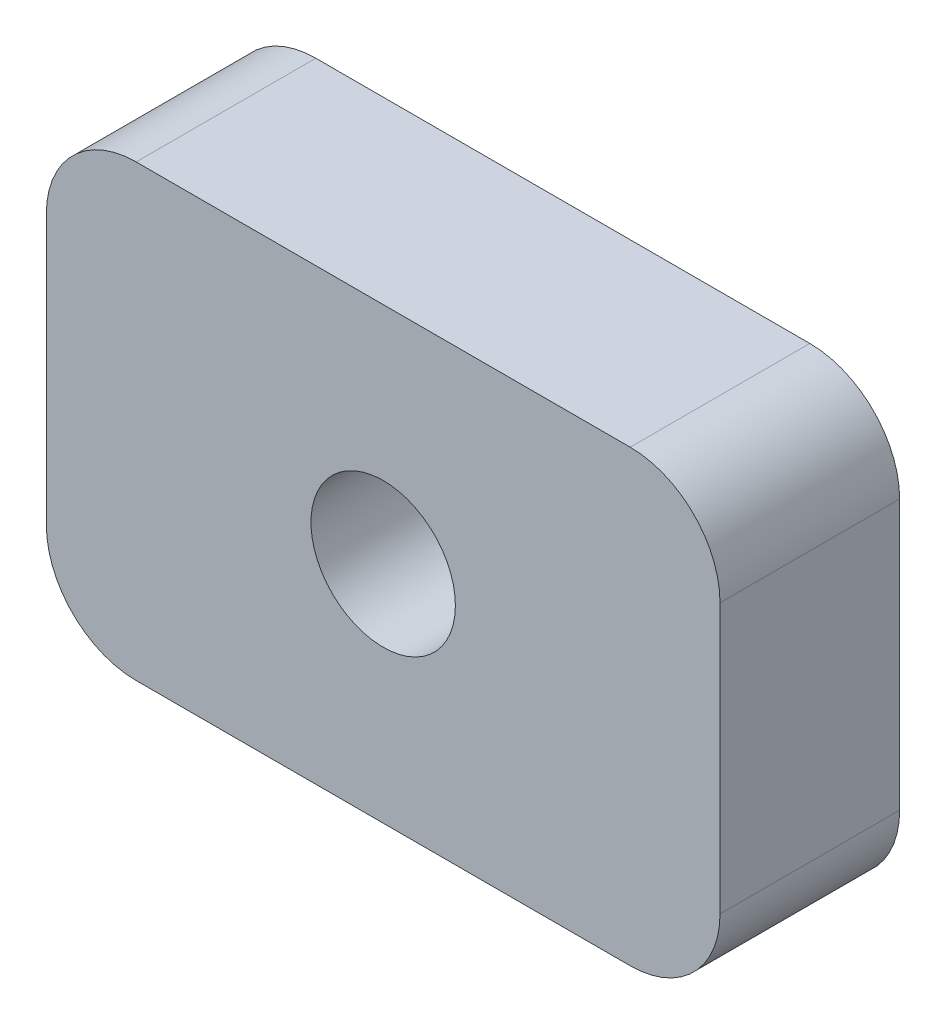
ISO-10303-21;
HEADER;
FILE_DESCRIPTION(('STEP AP214'),'2;1');
FILE_NAME('part.step','',(''),(''),'','','');
FILE_SCHEMA(('AUTOMOTIVE_DESIGN { 1 0 10303 214 1 1 1 1 }'));
ENDSEC;
DATA;
#1=APPLICATION_CONTEXT('core data for automotive mechanical design processes');
#2=APPLICATION_PROTOCOL_DEFINITION('international standard','automotive_design',2000,#1);
#3=PRODUCT_CONTEXT('',#1,'mechanical');
#4=PRODUCT('Part','Part','',(#3));
#5=PRODUCT_RELATED_PRODUCT_CATEGORY('part','',(#4));
#6=PRODUCT_DEFINITION_FORMATION('','',#4);
#7=PRODUCT_DEFINITION_CONTEXT('part definition',#1,'design');
#8=PRODUCT_DEFINITION('design','',#6,#7);
#9=PRODUCT_DEFINITION_SHAPE('','',#8);
#10=(LENGTH_UNIT() NAMED_UNIT(*) SI_UNIT(.MILLI.,.METRE.));
#11=(NAMED_UNIT(*) PLANE_ANGLE_UNIT() SI_UNIT($,.RADIAN.));
#12=(NAMED_UNIT(*) SI_UNIT($,.STERADIAN.) SOLID_ANGLE_UNIT());
#13=UNCERTAINTY_MEASURE_WITH_UNIT(LENGTH_MEASURE(1.E-05),#10,'distance_accuracy_value','');
#14=(GEOMETRIC_REPRESENTATION_CONTEXT(3) GLOBAL_UNCERTAINTY_ASSIGNED_CONTEXT((#13)) GLOBAL_UNIT_ASSIGNED_CONTEXT((#10,
#11,#12)) REPRESENTATION_CONTEXT('',''));
#15=CARTESIAN_POINT('',(0.,0.,0.));
#16=DIRECTION('',(0.,0.,1.));
#17=DIRECTION('',(1.,0.,0.));
#18=AXIS2_PLACEMENT_3D('',#15,#16,#17);
#19=CARTESIAN_POINT('',(-11.90625,7.93749999999999,6.35));
#20=DIRECTION('',(1.,0.,0.));
#21=DIRECTION('',(0.,1.,0.));
#22=AXIS2_PLACEMENT_3D('',#19,#20,#21);
#23=PLANE('',#22);
#24=DIRECTION('',(0.,-1.,0.));
#25=VECTOR('',#24,1.);
#26=CARTESIAN_POINT('',(-11.90625,7.93749999999999,0.));
#27=LINE('',#26,#25);
#28=CARTESIAN_POINT('',(-11.90625,4.76249999999999,0.));
#29=VERTEX_POINT('',#28);
#30=CARTESIAN_POINT('',(-11.90625,-4.7625,0.));
#31=VERTEX_POINT('',#30);
#32=EDGE_CURVE('E131',#29,#31,#27,.T.);
#33=ORIENTED_EDGE('',*,*,#32,.T.);
#34=DIRECTION('',(0.,0.,-1.));
#35=VECTOR('',#34,1.);
#36=CARTESIAN_POINT('',(-11.90625,-4.7625,6.35));
#37=LINE('',#36,#35);
#38=CARTESIAN_POINT('',(-11.90625,-4.7625,6.35));
#39=VERTEX_POINT('',#38);
#40=EDGE_CURVE('E109',#31,#39,#37,.F.);
#41=ORIENTED_EDGE('',*,*,#40,.T.);
#42=DIRECTION('',(0.,-1.,0.));
#43=VECTOR('',#42,1.);
#44=CARTESIAN_POINT('',(-11.90625,7.93749999999999,6.35));
#45=LINE('',#44,#43);
#46=CARTESIAN_POINT('',(-11.90625,4.76249999999999,6.35));
#47=VERTEX_POINT('',#46);
#48=EDGE_CURVE('E141',#47,#39,#45,.T.);
#49=ORIENTED_EDGE('',*,*,#48,.F.);
#50=DIRECTION('',(0.,0.,-1.));
#51=VECTOR('',#50,1.);
#52=CARTESIAN_POINT('',(-11.90625,4.76249999999999,6.35));
#53=LINE('',#52,#51);
#54=EDGE_CURVE('E114',#47,#29,#53,.T.);
#55=ORIENTED_EDGE('',*,*,#54,.T.);
#56=EDGE_LOOP('',(#33,#41,#49,#55));
#57=FACE_BOUND('',#56,.T.);
#58=ADVANCED_FACE('F38',(#57),#23,.F.);
#59=CARTESIAN_POINT('',(11.90625,-7.9375,6.35));
#60=DIRECTION('',(0.,1.,0.));
#61=DIRECTION('',(-1.,0.,0.));
#62=AXIS2_PLACEMENT_3D('',#59,#60,#61);
#63=PLANE('',#62);
#64=DIRECTION('',(1.,0.,0.));
#65=VECTOR('',#64,1.);
#66=CARTESIAN_POINT('',(11.90625,-7.9375,6.35));
#67=LINE('',#66,#65);
#68=CARTESIAN_POINT('',(-8.73124999999999,-7.93750000000001,6.35));
#69=VERTEX_POINT('',#68);
#70=CARTESIAN_POINT('',(8.73125000000001,-7.9375,6.35));
#71=VERTEX_POINT('',#70);
#72=EDGE_CURVE('E124',#69,#71,#67,.T.);
#73=ORIENTED_EDGE('',*,*,#72,.F.);
#74=DIRECTION('',(0.,0.,-1.));
#75=VECTOR('',#74,1.);
#76=CARTESIAN_POINT('',(-8.73124999999999,-7.93750000000001,6.35));
#77=LINE('',#76,#75);
#78=CARTESIAN_POINT('',(-8.73124999999999,-7.93750000000001,0.));
#79=VERTEX_POINT('',#78);
#80=EDGE_CURVE('E108',#69,#79,#77,.T.);
#81=ORIENTED_EDGE('',*,*,#80,.T.);
#82=DIRECTION('',(1.,0.,0.));
#83=VECTOR('',#82,1.);
#84=CARTESIAN_POINT('',(11.90625,-7.9375,0.));
#85=LINE('',#84,#83);
#86=CARTESIAN_POINT('',(8.73125000000001,-7.9375,0.));
#87=VERTEX_POINT('',#86);
#88=EDGE_CURVE('E121',#79,#87,#85,.T.);
#89=ORIENTED_EDGE('',*,*,#88,.T.);
#90=DIRECTION('',(0.,0.,-1.));
#91=VECTOR('',#90,1.);
#92=CARTESIAN_POINT('',(8.73125000000001,-7.9375,6.35));
#93=LINE('',#92,#91);
#94=EDGE_CURVE('E126',#87,#71,#93,.F.);
#95=ORIENTED_EDGE('',*,*,#94,.T.);
#96=EDGE_LOOP('',(#73,#81,#89,#95));
#97=FACE_BOUND('',#96,.T.);
#98=ADVANCED_FACE('F120',(#97),#63,.F.);
#99=CARTESIAN_POINT('',(11.90625,7.9375,6.35));
#100=DIRECTION('',(-1.,0.,0.));
#101=DIRECTION('',(0.,-1.,0.));
#102=AXIS2_PLACEMENT_3D('',#99,#100,#101);
#103=PLANE('',#102);
#104=DIRECTION('',(0.,1.,0.));
#105=VECTOR('',#104,1.);
#106=CARTESIAN_POINT('',(11.90625,7.9375,6.35));
#107=LINE('',#106,#105);
#108=CARTESIAN_POINT('',(11.90625,-4.7625,6.35));
#109=VERTEX_POINT('',#108);
#110=CARTESIAN_POINT('',(11.90625,4.7625,6.35));
#111=VERTEX_POINT('',#110);
#112=EDGE_CURVE('E167',#109,#111,#107,.T.);
#113=ORIENTED_EDGE('',*,*,#112,.F.);
#114=DIRECTION('',(0.,0.,-1.));
#115=VECTOR('',#114,1.);
#116=CARTESIAN_POINT('',(11.90625,-4.7625,6.35));
#117=LINE('',#116,#115);
#118=CARTESIAN_POINT('',(11.90625,-4.7625,0.));
#119=VERTEX_POINT('',#118);
#120=EDGE_CURVE('E160',#109,#119,#117,.T.);
#121=ORIENTED_EDGE('',*,*,#120,.T.);
#122=DIRECTION('',(0.,1.,0.));
#123=VECTOR('',#122,1.);
#124=CARTESIAN_POINT('',(11.90625,7.9375,0.));
#125=LINE('',#124,#123);
#126=CARTESIAN_POINT('',(11.90625,4.7625,0.));
#127=VERTEX_POINT('',#126);
#128=EDGE_CURVE('E130',#119,#127,#125,.T.);
#129=ORIENTED_EDGE('',*,*,#128,.T.);
#130=DIRECTION('',(0.,0.,-1.));
#131=VECTOR('',#130,1.);
#132=CARTESIAN_POINT('',(11.90625,4.7625,6.35));
#133=LINE('',#132,#131);
#134=EDGE_CURVE('E158',#127,#111,#133,.F.);
#135=ORIENTED_EDGE('',*,*,#134,.T.);
#136=EDGE_LOOP('',(#113,#121,#129,#135));
#137=FACE_BOUND('',#136,.T.);
#138=ADVANCED_FACE('F165',(#137),#103,.F.);
#139=CARTESIAN_POINT('',(11.90625,7.9375,6.35));
#140=DIRECTION('',(0.,-1.,0.));
#141=DIRECTION('',(1.,0.,0.));
#142=AXIS2_PLACEMENT_3D('',#139,#140,#141);
#143=PLANE('',#142);
#144=DIRECTION('',(-1.,0.,0.));
#145=VECTOR('',#144,1.);
#146=CARTESIAN_POINT('',(11.90625,7.9375,6.35));
#147=LINE('',#146,#145);
#148=CARTESIAN_POINT('',(8.73125,7.9375,6.35));
#149=VERTEX_POINT('',#148);
#150=CARTESIAN_POINT('',(-8.73125,7.93749999999999,6.35));
#151=VERTEX_POINT('',#150);
#152=EDGE_CURVE('E142',#149,#151,#147,.T.);
#153=ORIENTED_EDGE('',*,*,#152,.F.);
#154=DIRECTION('',(0.,0.,-1.));
#155=VECTOR('',#154,1.);
#156=CARTESIAN_POINT('',(8.73125,7.9375,6.35));
#157=LINE('',#156,#155);
#158=CARTESIAN_POINT('',(8.73125,7.9375,0.));
#159=VERTEX_POINT('',#158);
#160=EDGE_CURVE('E11',#149,#159,#157,.T.);
#161=ORIENTED_EDGE('',*,*,#160,.T.);
#162=DIRECTION('',(-1.,0.,0.));
#163=VECTOR('',#162,1.);
#164=CARTESIAN_POINT('',(11.90625,7.9375,0.));
#165=LINE('',#164,#163);
#166=CARTESIAN_POINT('',(-8.73125,7.93749999999999,0.));
#167=VERTEX_POINT('',#166);
#168=EDGE_CURVE('E134',#159,#167,#165,.T.);
#169=ORIENTED_EDGE('',*,*,#168,.T.);
#170=DIRECTION('',(0.,0.,-1.));
#171=VECTOR('',#170,1.);
#172=CARTESIAN_POINT('',(-8.73125,7.93749999999999,6.35));
#173=LINE('',#172,#171);
#174=EDGE_CURVE('E46',#167,#151,#173,.F.);
#175=ORIENTED_EDGE('',*,*,#174,.T.);
#176=EDGE_LOOP('',(#153,#161,#169,#175));
#177=FACE_BOUND('',#176,.T.);
#178=ADVANCED_FACE('F174',(#177),#143,.F.);
#179=CARTESIAN_POINT('',(-11.90625,-7.93750000000001,6.35));
#180=DIRECTION('',(0.,0.,-1.));
#181=DIRECTION('',(-1.,0.,0.));
#182=AXIS2_PLACEMENT_3D('',#179,#180,#181);
#183=PLANE('',#182);
#184=CARTESIAN_POINT('',(0.,0.,6.35));
#185=DIRECTION('',(0.,0.,1.));
#186=DIRECTION('',(1.,0.,0.));
#187=AXIS2_PLACEMENT_3D('',#184,#185,#186);
#188=CIRCLE('',#187,2.5527);
#189=CARTESIAN_POINT('',(2.5527,0.,6.35));
#190=VERTEX_POINT('',#189);
#191=EDGE_CURVE('E183',#190,#190,#188,.T.);
#192=ORIENTED_EDGE('',*,*,#191,.F.);
#193=EDGE_LOOP('',(#192));
#194=FACE_BOUND('',#193,.T.);
#195=ORIENTED_EDGE('',*,*,#48,.T.);
#196=CARTESIAN_POINT('',(-8.73124999999999,-4.7625,6.35));
#197=DIRECTION('',(0.,0.,-1.));
#198=DIRECTION('',(-1.,0.,0.));
#199=AXIS2_PLACEMENT_3D('',#196,#197,#198);
#200=CIRCLE('',#199,3.175);
#201=EDGE_CURVE('E156',#39,#69,#200,.F.);
#202=ORIENTED_EDGE('',*,*,#201,.T.);
#203=ORIENTED_EDGE('',*,*,#72,.T.);
#204=CARTESIAN_POINT('',(8.73125000000001,-4.7625,6.35));
#205=DIRECTION('',(0.,0.,-1.));
#206=DIRECTION('',(-1.,0.,0.));
#207=AXIS2_PLACEMENT_3D('',#204,#205,#206);
#208=CIRCLE('',#207,3.175);
#209=EDGE_CURVE('E154',#71,#109,#208,.F.);
#210=ORIENTED_EDGE('',*,*,#209,.T.);
#211=ORIENTED_EDGE('',*,*,#112,.T.);
#212=CARTESIAN_POINT('',(8.73125,4.7625,6.35));
#213=DIRECTION('',(0.,0.,-1.));
#214=DIRECTION('',(-1.,0.,0.));
#215=AXIS2_PLACEMENT_3D('',#212,#213,#214);
#216=CIRCLE('',#215,3.175);
#217=EDGE_CURVE('E59',#111,#149,#216,.F.);
#218=ORIENTED_EDGE('',*,*,#217,.T.);
#219=ORIENTED_EDGE('',*,*,#152,.T.);
#220=CARTESIAN_POINT('',(-8.73125,4.7625,6.35));
#221=DIRECTION('',(0.,0.,-1.));
#222=DIRECTION('',(-1.,0.,0.));
#223=AXIS2_PLACEMENT_3D('',#220,#221,#222);
#224=CIRCLE('',#223,3.175);
#225=EDGE_CURVE('E151',#151,#47,#224,.F.);
#226=ORIENTED_EDGE('',*,*,#225,.T.);
#227=EDGE_LOOP('',(#195,#202,#203,#210,#211,#218,#219,#226));
#228=FACE_BOUND('',#227,.T.);
#229=ADVANCED_FACE('F190',(#194,#228),#183,.F.);
#230=CARTESIAN_POINT('',(-11.90625,-7.93750000000001,0.));
#231=DIRECTION('',(0.,0.,-1.));
#232=DIRECTION('',(-1.,0.,0.));
#233=AXIS2_PLACEMENT_3D('',#230,#231,#232);
#234=PLANE('',#233);
#235=CARTESIAN_POINT('',(0.,0.,0.));
#236=DIRECTION('',(0.,0.,-1.));
#237=DIRECTION('',(-1.,0.,0.));
#238=AXIS2_PLACEMENT_3D('',#235,#236,#237);
#239=CIRCLE('',#238,2.5527);
#240=CARTESIAN_POINT('',(-2.5527,0.,0.));
#241=VERTEX_POINT('',#240);
#242=EDGE_CURVE('E136',#241,#241,#239,.T.);
#243=ORIENTED_EDGE('',*,*,#242,.F.);
#244=EDGE_LOOP('',(#243));
#245=FACE_BOUND('',#244,.T.);
#246=ORIENTED_EDGE('',*,*,#88,.F.);
#247=CARTESIAN_POINT('',(-8.73124999999999,-4.7625,0.));
#248=DIRECTION('',(0.,0.,-1.));
#249=DIRECTION('',(-1.,0.,0.));
#250=AXIS2_PLACEMENT_3D('',#247,#248,#249);
#251=CIRCLE('',#250,3.175);
#252=EDGE_CURVE('E104',#79,#31,#251,.T.);
#253=ORIENTED_EDGE('',*,*,#252,.T.);
#254=ORIENTED_EDGE('',*,*,#32,.F.);
#255=CARTESIAN_POINT('',(-8.73125,4.7625,0.));
#256=DIRECTION('',(0.,0.,-1.));
#257=DIRECTION('',(-1.,0.,0.));
#258=AXIS2_PLACEMENT_3D('',#255,#256,#257);
#259=CIRCLE('',#258,3.175);
#260=EDGE_CURVE('E125',#29,#167,#259,.T.);
#261=ORIENTED_EDGE('',*,*,#260,.T.);
#262=ORIENTED_EDGE('',*,*,#168,.F.);
#263=CARTESIAN_POINT('',(8.73125,4.7625,0.));
#264=DIRECTION('',(0.,0.,-1.));
#265=DIRECTION('',(-1.,0.,0.));
#266=AXIS2_PLACEMENT_3D('',#263,#264,#265);
#267=CIRCLE('',#266,3.175);
#268=EDGE_CURVE('E145',#159,#127,#267,.T.);
#269=ORIENTED_EDGE('',*,*,#268,.T.);
#270=ORIENTED_EDGE('',*,*,#128,.F.);
#271=CARTESIAN_POINT('',(8.73125000000001,-4.7625,0.));
#272=DIRECTION('',(0.,0.,-1.));
#273=DIRECTION('',(-1.,0.,0.));
#274=AXIS2_PLACEMENT_3D('',#271,#272,#273);
#275=CIRCLE('',#274,3.175);
#276=EDGE_CURVE('E115',#119,#87,#275,.T.);
#277=ORIENTED_EDGE('',*,*,#276,.T.);
#278=EDGE_LOOP('',(#246,#253,#254,#261,#262,#269,#270,#277));
#279=FACE_BOUND('',#278,.T.);
#280=ADVANCED_FACE('F128',(#245,#279),#234,.T.);
#281=CARTESIAN_POINT('',(0.,0.,6.35));
#282=DIRECTION('',(0.,0.,1.));
#283=DIRECTION('',(1.,0.,0.));
#284=AXIS2_PLACEMENT_3D('',#281,#282,#283);
#285=CYLINDRICAL_SURFACE('',#284,2.5527);
#286=ORIENTED_EDGE('',*,*,#191,.T.);
#287=EDGE_LOOP('',(#286));
#288=FACE_BOUND('',#287,.T.);
#289=ORIENTED_EDGE('',*,*,#242,.T.);
#290=EDGE_LOOP('',(#289));
#291=FACE_BOUND('',#290,.T.);
#292=ADVANCED_FACE('F187',(#288,#291),#285,.F.);
#293=CARTESIAN_POINT('',(-8.73124999999999,-4.7625,6.35));
#294=DIRECTION('',(0.,0.,-1.));
#295=DIRECTION('',(-1.,0.,0.));
#296=AXIS2_PLACEMENT_3D('',#293,#294,#295);
#297=CYLINDRICAL_SURFACE('',#296,3.175);
#298=ORIENTED_EDGE('',*,*,#201,.F.);
#299=ORIENTED_EDGE('',*,*,#40,.F.);
#300=ORIENTED_EDGE('',*,*,#252,.F.);
#301=ORIENTED_EDGE('',*,*,#80,.F.);
#302=EDGE_LOOP('',(#298,#299,#300,#301));
#303=FACE_BOUND('',#302,.T.);
#304=ADVANCED_FACE('F107',(#303),#297,.T.);
#305=CARTESIAN_POINT('',(8.73125000000001,-4.7625,6.35));
#306=DIRECTION('',(0.,0.,-1.));
#307=DIRECTION('',(-1.,0.,0.));
#308=AXIS2_PLACEMENT_3D('',#305,#306,#307);
#309=CYLINDRICAL_SURFACE('',#308,3.175);
#310=ORIENTED_EDGE('',*,*,#209,.F.);
#311=ORIENTED_EDGE('',*,*,#94,.F.);
#312=ORIENTED_EDGE('',*,*,#276,.F.);
#313=ORIENTED_EDGE('',*,*,#120,.F.);
#314=EDGE_LOOP('',(#310,#311,#312,#313));
#315=FACE_BOUND('',#314,.T.);
#316=ADVANCED_FACE('F201',(#315),#309,.T.);
#317=CARTESIAN_POINT('',(8.73125,4.7625,6.35));
#318=DIRECTION('',(0.,0.,-1.));
#319=DIRECTION('',(-1.,0.,0.));
#320=AXIS2_PLACEMENT_3D('',#317,#318,#319);
#321=CYLINDRICAL_SURFACE('',#320,3.175);
#322=ORIENTED_EDGE('',*,*,#217,.F.);
#323=ORIENTED_EDGE('',*,*,#134,.F.);
#324=ORIENTED_EDGE('',*,*,#268,.F.);
#325=ORIENTED_EDGE('',*,*,#160,.F.);
#326=EDGE_LOOP('',(#322,#323,#324,#325));
#327=FACE_BOUND('',#326,.T.);
#328=ADVANCED_FACE('F173',(#327),#321,.T.);
#329=CARTESIAN_POINT('',(-8.73125,4.7625,6.35));
#330=DIRECTION('',(0.,0.,-1.));
#331=DIRECTION('',(-1.,0.,0.));
#332=AXIS2_PLACEMENT_3D('',#329,#330,#331);
#333=CYLINDRICAL_SURFACE('',#332,3.175);
#334=ORIENTED_EDGE('',*,*,#225,.F.);
#335=ORIENTED_EDGE('',*,*,#174,.F.);
#336=ORIENTED_EDGE('',*,*,#260,.F.);
#337=ORIENTED_EDGE('',*,*,#54,.F.);
#338=EDGE_LOOP('',(#334,#335,#336,#337));
#339=FACE_BOUND('',#338,.T.);
#340=ADVANCED_FACE('F40',(#339),#333,.T.);
#341=CLOSED_SHELL('',(#58,#98,#138,#178,#229,#280,#292,#304,#316,#328,#340));
#342=MANIFOLD_SOLID_BREP('B2',#341);
#343=ADVANCED_BREP_SHAPE_REPRESENTATION('',(#18,#342),#14);
#344=SHAPE_DEFINITION_REPRESENTATION(#9,#343);
ENDSEC;
END-ISO-10303-21;
